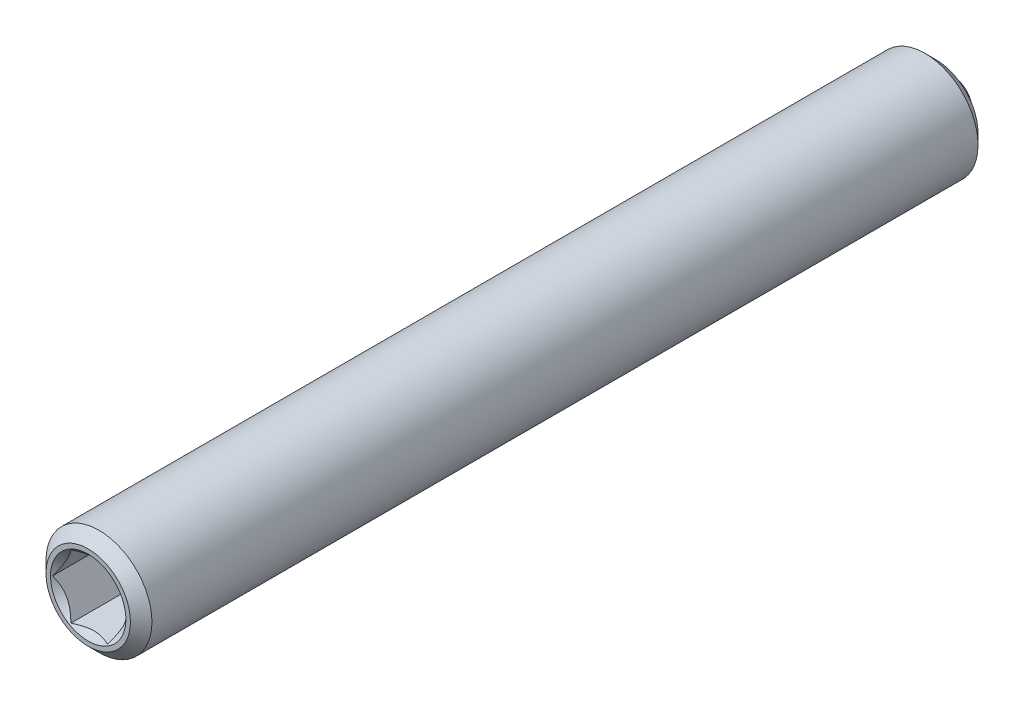
ISO-10303-21;
HEADER;
FILE_DESCRIPTION(('STEP AP214'),'2;1');
FILE_NAME('part.step','',(''),(''),'','','');
FILE_SCHEMA(('AUTOMOTIVE_DESIGN { 1 0 10303 214 1 1 1 1 }'));
ENDSEC;
DATA;
#1=APPLICATION_CONTEXT('core data for automotive mechanical design processes');
#2=APPLICATION_PROTOCOL_DEFINITION('international standard','automotive_design',2000,#1);
#3=PRODUCT_CONTEXT('',#1,'mechanical');
#4=PRODUCT('Part','Part','',(#3));
#5=PRODUCT_RELATED_PRODUCT_CATEGORY('part','',(#4));
#6=PRODUCT_DEFINITION_FORMATION('','',#4);
#7=PRODUCT_DEFINITION_CONTEXT('part definition',#1,'design');
#8=PRODUCT_DEFINITION('design','',#6,#7);
#9=PRODUCT_DEFINITION_SHAPE('','',#8);
#10=(LENGTH_UNIT() NAMED_UNIT(*) SI_UNIT(.MILLI.,.METRE.));
#11=(NAMED_UNIT(*) PLANE_ANGLE_UNIT() SI_UNIT($,.RADIAN.));
#12=(NAMED_UNIT(*) SI_UNIT($,.STERADIAN.) SOLID_ANGLE_UNIT());
#13=UNCERTAINTY_MEASURE_WITH_UNIT(LENGTH_MEASURE(1.E-05),#10,'distance_accuracy_value','');
#14=(GEOMETRIC_REPRESENTATION_CONTEXT(3) GLOBAL_UNCERTAINTY_ASSIGNED_CONTEXT((#13)) GLOBAL_UNIT_ASSIGNED_CONTEXT((#10,
#11,#12)) REPRESENTATION_CONTEXT('',''));
#15=CARTESIAN_POINT('',(0.,0.,0.));
#16=DIRECTION('',(0.,0.,1.));
#17=DIRECTION('',(1.,0.,0.));
#18=AXIS2_PLACEMENT_3D('',#15,#16,#17);
#19=CARTESIAN_POINT('',(-33.1630007981403,28.7089673374794,7.99521483447506));
#20=DIRECTION('',(0.,0.,-1.));
#21=DIRECTION('',(-1.,0.,0.));
#22=AXIS2_PLACEMENT_3D('',#19,#20,#21);
#23=PLANE('',#22);
#24=CARTESIAN_POINT('',(-33.1630007981403,28.7089673374794,7.99521483447506));
#25=DIRECTION('',(0.,0.,-1.));
#26=DIRECTION('',(0.,1.,0.));
#27=AXIS2_PLACEMENT_3D('',#24,#25,#26);
#28=CIRCLE('',#27,0.889);
#29=CARTESIAN_POINT('',(-33.1630007981403,29.5979673374794,7.99521483447506));
#30=VERTEX_POINT('',#29);
#31=EDGE_CURVE('P0_E164',#30,#30,#28,.T.);
#32=ORIENTED_EDGE('',*,*,#31,.T.);
#33=EDGE_LOOP('',(#32));
#34=FACE_BOUND('',#33,.T.);
#35=CARTESIAN_POINT('',(-33.1630007981403,28.7089673374794,7.99521483447506));
#36=DIRECTION('',(0.,0.,1.));
#37=DIRECTION('',(1.,0.,0.));
#38=AXIS2_PLACEMENT_3D('',#35,#36,#37);
#39=CIRCLE('',#38,0.996);
#40=CARTESIAN_POINT('',(-32.1670007981403,28.7089673374794,7.99521483447506));
#41=VERTEX_POINT('',#40);
#42=EDGE_CURVE('P0_E29',#41,#41,#39,.T.);
#43=ORIENTED_EDGE('',*,*,#42,.T.);
#44=EDGE_LOOP('',(#43));
#45=FACE_BOUND('',#44,.T.);
#46=ADVANCED_FACE('P0_F17',(#34,#45),#23,.F.);
#47=CARTESIAN_POINT('',(-33.1630007981403,28.7089673374794,7.74121483447506));
#48=DIRECTION('',(0.,0.,-1.));
#49=DIRECTION('',(-1.,0.,0.));
#50=AXIS2_PLACEMENT_3D('',#47,#48,#49);
#51=CONICAL_SURFACE('',#50,1.25,0.78539816339744);
#52=ORIENTED_EDGE('',*,*,#42,.F.);
#53=EDGE_LOOP('',(#52));
#54=FACE_BOUND('',#53,.T.);
#55=CARTESIAN_POINT('',(-33.1630007981403,28.7089673374794,7.74121483447506));
#56=DIRECTION('',(0.,0.,1.));
#57=DIRECTION('',(1.,0.,0.));
#58=AXIS2_PLACEMENT_3D('',#55,#56,#57);
#59=CIRCLE('',#58,1.25);
#60=CARTESIAN_POINT('',(-31.9130007981403,28.7089673374794,7.74121483447506));
#61=VERTEX_POINT('',#60);
#62=EDGE_CURVE('P0_E113',#61,#61,#59,.T.);
#63=ORIENTED_EDGE('',*,*,#62,.T.);
#64=EDGE_LOOP('',(#63));
#65=FACE_BOUND('',#64,.T.);
#66=ADVANCED_FACE('P0_F119',(#54,#65),#51,.T.);
#67=CARTESIAN_POINT('',(-33.1630007981403,28.7089673374794,57.6778825031788));
#68=DIRECTION('',(0.,0.,1.));
#69=DIRECTION('',(1.,0.,0.));
#70=AXIS2_PLACEMENT_3D('',#67,#68,#69);
#71=CYLINDRICAL_SURFACE('',#70,1.25);
#72=ORIENTED_EDGE('',*,*,#62,.F.);
#73=EDGE_LOOP('',(#72));
#74=FACE_BOUND('',#73,.T.);
#75=CARTESIAN_POINT('',(-33.1630007981403,28.7089673374794,-11.7507851655249));
#76=DIRECTION('',(0.,0.,1.));
#77=DIRECTION('',(1.,0.,0.));
#78=AXIS2_PLACEMENT_3D('',#75,#76,#77);
#79=CIRCLE('',#78,1.25);
#80=CARTESIAN_POINT('',(-31.9130007981403,28.7089673374794,-11.7507851655249));
#81=VERTEX_POINT('',#80);
#82=EDGE_CURVE('P0_E110',#81,#81,#79,.T.);
#83=ORIENTED_EDGE('',*,*,#82,.T.);
#84=EDGE_LOOP('',(#83));
#85=FACE_BOUND('',#84,.T.);
#86=ADVANCED_FACE('P0_F122',(#74,#85),#71,.T.);
#87=CARTESIAN_POINT('',(-33.1630007981403,28.7089673374794,-12.0047851655249));
#88=DIRECTION('',(0.,0.,1.));
#89=DIRECTION('',(1.,0.,0.));
#90=AXIS2_PLACEMENT_3D('',#87,#88,#89);
#91=CONICAL_SURFACE('',#90,0.996,0.78539816339744);
#92=ORIENTED_EDGE('',*,*,#82,.F.);
#93=EDGE_LOOP('',(#92));
#94=FACE_BOUND('',#93,.T.);
#95=CARTESIAN_POINT('',(-33.1630007981403,28.7089673374794,-12.0047851655249));
#96=DIRECTION('',(0.,0.,1.));
#97=DIRECTION('',(1.,0.,0.));
#98=AXIS2_PLACEMENT_3D('',#95,#96,#97);
#99=CIRCLE('',#98,0.996);
#100=CARTESIAN_POINT('',(-32.1670007981403,28.7089673374794,-12.0047851655249));
#101=VERTEX_POINT('',#100);
#102=EDGE_CURVE('P0_E107',#101,#101,#99,.T.);
#103=ORIENTED_EDGE('',*,*,#102,.T.);
#104=EDGE_LOOP('',(#103));
#105=FACE_BOUND('',#104,.T.);
#106=ADVANCED_FACE('P0_F127',(#94,#105),#91,.T.);
#107=CARTESIAN_POINT('',(-33.1630007981403,29.7049673374794,-12.0047851655249));
#108=DIRECTION('',(0.,0.,1.));
#109=DIRECTION('',(1.,0.,0.));
#110=AXIS2_PLACEMENT_3D('',#107,#108,#109);
#111=PLANE('',#110);
#112=ORIENTED_EDGE('',*,*,#102,.F.);
#113=EDGE_LOOP('',(#112));
#114=FACE_BOUND('',#113,.T.);
#115=CARTESIAN_POINT('',(-33.1630007981403,28.7089673374794,-12.0047851655249));
#116=DIRECTION('',(0.,0.,1.));
#117=DIRECTION('',(1.,0.,0.));
#118=AXIS2_PLACEMENT_3D('',#115,#116,#117);
#119=CIRCLE('',#118,0.75);
#120=CARTESIAN_POINT('',(-32.4130007981403,28.7089673374794,-12.0047851655249));
#121=VERTEX_POINT('',#120);
#122=EDGE_CURVE('P0_E104',#121,#121,#119,.T.);
#123=ORIENTED_EDGE('',*,*,#122,.T.);
#124=EDGE_LOOP('',(#123));
#125=FACE_BOUND('',#124,.T.);
#126=ADVANCED_FACE('P0_F133',(#114,#125),#111,.F.);
#127=CARTESIAN_POINT('',(-33.1630007981403,28.7089673374794,57.6778825031788));
#128=DIRECTION('',(0.,0.,1.));
#129=DIRECTION('',(1.,0.,0.));
#130=AXIS2_PLACEMENT_3D('',#127,#128,#129);
#131=CYLINDRICAL_SURFACE('',#130,0.75);
#132=ORIENTED_EDGE('',*,*,#122,.F.);
#133=EDGE_LOOP('',(#132));
#134=FACE_BOUND('',#133,.T.);
#135=CARTESIAN_POINT('',(-33.1630007981403,28.7089673374794,-11.5029249937451));
#136=DIRECTION('',(0.,0.,1.));
#137=DIRECTION('',(1.,0.,0.));
#138=AXIS2_PLACEMENT_3D('',#135,#136,#137);
#139=CIRCLE('',#138,0.75);
#140=CARTESIAN_POINT('',(-32.4130007981403,28.7089673374794,-11.5029249937451));
#141=VERTEX_POINT('',#140);
#142=EDGE_CURVE('P0_E101',#141,#141,#139,.T.);
#143=ORIENTED_EDGE('',*,*,#142,.T.);
#144=EDGE_LOOP('',(#143));
#145=FACE_BOUND('',#144,.T.);
#146=ADVANCED_FACE('P0_F139',(#134,#145),#131,.F.);
#147=CARTESIAN_POINT('',(-33.1630007981403,28.7089673374794,-10.7529249937451));
#148=DIRECTION('',(0.,0.,-1.));
#149=DIRECTION('',(-1.,0.,0.));
#150=AXIS2_PLACEMENT_3D('',#147,#148,#149);
#151=CONICAL_SURFACE('',#150,0.,0.785398163397435);
#152=ORIENTED_EDGE('',*,*,#142,.F.);
#153=EDGE_LOOP('',(#152));
#154=FACE_BOUND('',#153,.T.);
#155=CARTESIAN_POINT('',(-33.1630007981403,28.7089673374794,-10.7529249937451));
#156=VERTEX_POINT('',#155);
#157=VERTEX_LOOP('',#156);
#158=FACE_BOUND('',#157,.T.);
#159=ADVANCED_FACE('P0_F145',(#154,#158),#151,.F.);
#160=CARTESIAN_POINT('',(-33.1630007981403,28.7089673374794,7.10621483447507));
#161=DIRECTION('',(0.,0.,1.));
#162=DIRECTION('',(0.,-1.,0.));
#163=AXIS2_PLACEMENT_3D('',#160,#161,#162);
#164=CONICAL_SURFACE('',#163,0.,0.785398163397454);
#165=ORIENTED_EDGE('',*,*,#31,.F.);
#166=EDGE_LOOP('',(#165));
#167=FACE_BOUND('',#166,.T.);
#168=CARTESIAN_POINT('',(-34.0425134321986,27.9589673374794,8.26208786966026));
#169=CARTESIAN_POINT('',(-34.0211681100344,27.9589673374794,8.24584847947383));
#170=CARTESIAN_POINT('',(-33.9997055705422,27.9589673374794,8.22976358783385));
#171=CARTESIAN_POINT('',(-33.9564979950275,27.9589673374794,8.19796706739638));
#172=CARTESIAN_POINT('',(-33.9347528915436,27.9589673374794,8.18225553036632));
#173=CARTESIAN_POINT('',(-33.8687032144859,27.9589673374794,8.13555296646633));
#174=CARTESIAN_POINT('',(-33.8239085172943,27.9589673374794,8.10524382432147));
#175=CARTESIAN_POINT('',(-33.7298709247186,27.9589673374794,8.04559584174304));
#176=CARTESIAN_POINT('',(-33.6805219918868,27.9589673374794,8.01642227384624));
#177=CARTESIAN_POINT('',(-33.579342395383,27.9589673374794,7.96295382695283));
#178=CARTESIAN_POINT('',(-33.5275208693121,27.9589673374794,7.93864248318659));
#179=CARTESIAN_POINT('',(-33.4498788861714,27.9589673374794,7.90889806815176));
#180=CARTESIAN_POINT('',(-33.4252462031009,27.9589673374794,7.90038894634061));
#181=CARTESIAN_POINT('',(-33.3753858857222,27.9589673374794,7.88534110821305));
#182=CARTESIAN_POINT('',(-33.3501582118539,27.9589673374794,7.87880252331568));
#183=CARTESIAN_POINT('',(-33.2746553170791,27.9589673374794,7.86292205991524));
#184=CARTESIAN_POINT('',(-33.2235971883066,27.9589673374794,7.85692036145107));
#185=CARTESIAN_POINT('',(-33.1233397305914,27.9589673374794,7.85565407881637));
#186=CARTESIAN_POINT('',(-33.0741456969587,27.9589673374794,7.85997925251151));
#187=CARTESIAN_POINT('',(-33.0012050800911,27.9589673374794,7.87307755969887));
#188=CARTESIAN_POINT('',(-32.9768127738478,27.9589673374794,7.87862812797235));
#189=CARTESIAN_POINT('',(-32.9285520824627,27.9589673374794,7.89166394378377));
#190=CARTESIAN_POINT('',(-32.9046836591211,27.9589673374794,7.89914904975033));
#191=CARTESIAN_POINT('',(-32.8302496642989,27.9589673374794,7.92532907949656));
#192=CARTESIAN_POINT('',(-32.7807289039953,27.9589673374794,7.94697769298002));
#193=CARTESIAN_POINT('',(-32.6840052994642,27.9589673374794,7.99512867272661));
#194=CARTESIAN_POINT('',(-32.6368115002835,27.9589673374794,8.02164833509716));
#195=CARTESIAN_POINT('',(-32.546608344391,27.9589673374794,8.07638182509845));
#196=CARTESIAN_POINT('',(-32.5035074965681,27.9589673374794,8.10444679240507));
#197=CARTESIAN_POINT('',(-32.4400071849266,27.9589673374794,8.14784121680964));
#198=CARTESIAN_POINT('',(-32.4191140713776,27.9589673374794,8.16246076309093));
#199=CARTESIAN_POINT('',(-32.3776138434408,27.9589673374794,8.19208888193887));
#200=CARTESIAN_POINT('',(-32.3570066523079,27.9589673374794,8.20709734688724));
#201=CARTESIAN_POINT('',(-32.3365186272487,27.9589673374794,8.22226715350033));
#202=B_SPLINE_CURVE_WITH_KNOTS('',3,(#168,#169,#170,#171,#172,#173,#174,#175,#176,#177,#178,
#179,#180,#181,#182,#183,#184,#185,#186,#187,#188,#189,#190,#191,#192,#193,#194,#195,#196,#197,
#198,#199,#200,#201),.UNSPECIFIED.,.F.,.F.,(4,2,2,2,2,2,2,2,2,2,2,2,2,2,2,2,4),(0.,
0.0804596117681692,0.160938799452028,0.323124453194978,0.494968571191827,0.66622054222909,
0.74433117166594,0.822447009304216,0.975597152051806,1.1227651436875,1.19774306447282,
1.2727154998528,1.43438364653412,1.59663734906445,1.75085876684993,1.82735598888856,
1.90383226465776),.UNSPECIFIED.);
#203=CARTESIAN_POINT('',(-33.5960135000325,27.9589673374794,7.9722402382595));
#204=VERTEX_POINT('',#203);
#205=CARTESIAN_POINT('',(-32.7299880962481,27.9589673374794,7.9722402382595));
#206=VERTEX_POINT('',#205);
#207=EDGE_CURVE('P0_E85',#204,#206,#202,.T.);
#208=ORIENTED_EDGE('',*,*,#207,.F.);
#209=CARTESIAN_POINT('',(-34.0291416719786,28.7091673374794,7.97235573140427));
#210=CARTESIAN_POINT('',(-34.0142518301535,28.6833773749217,7.95747434872343));
#211=CARTESIAN_POINT('',(-33.9991129904287,28.6571561353507,7.94346650386646));
#212=CARTESIAN_POINT('',(-33.9682429340346,28.6036876292437,7.91781776294176));
#213=CARTESIAN_POINT('',(-33.9525087771001,28.5764352700188,7.90619114996517));
#214=CARTESIAN_POINT('',(-33.9207814844129,28.5214819870981,7.88627428403174));
#215=CARTESIAN_POINT('',(-33.9047964415994,28.4937950807839,7.87793393234087));
#216=CARTESIAN_POINT('',(-33.8724744460836,28.4378117423485,7.86508298022093));
#217=CARTESIAN_POINT('',(-33.8561384820408,28.4095170226358,7.86056277884834));
#218=CARTESIAN_POINT('',(-33.8279868976807,28.3607570482106,7.85648607135694));
#219=CARTESIAN_POINT('',(-33.8162079265919,28.3403552718238,7.85588303487358));
#220=CARTESIAN_POINT('',(-33.792672780358,28.299591202783,7.85689474427503));
#221=CARTESIAN_POINT('',(-33.7809166108125,28.279228919828,7.85850997924953));
#222=CARTESIAN_POINT('',(-33.7458159514267,28.2184327943926,7.86657638523254));
#223=CARTESIAN_POINT('',(-33.722646127693,28.1783014824833,7.87624917408722));
#224=CARTESIAN_POINT('',(-33.6819749504676,28.1078569371254,7.89959655623182));
#225=CARTESIAN_POINT('',(-33.6642831070638,28.0772137654703,7.91204879633176));
#226=CARTESIAN_POINT('',(-33.6295925693883,28.0171279916746,7.94009984849036));
#227=CARTESIAN_POINT('',(-33.612591831045,27.9876818490978,7.95568842416325));
#228=CARTESIAN_POINT('',(-33.5958980299787,27.9587673374794,7.97235573140427));
#229=B_SPLINE_CURVE_WITH_KNOTS('',3,(#209,#210,#211,#212,#213,#214,#215,#216,#217,#218,#219,
#220,#221,#222,#223,#224,#225,#226,#227,#228),.UNSPECIFIED.,.F.,.F.,(4,2,2,2,2,2,2,2,2,4),(0.,
0.0999419466095622,0.200466857654447,0.299393763705727,0.39807129730023,0.468665775681749,
0.539275821398842,0.68053625724457,0.792918418368075,0.904939568716029),.UNSPECIFIED.);
#230=CARTESIAN_POINT('',(-34.0290262019247,28.7089673374794,7.9722402382595));
#231=VERTEX_POINT('',#230);
#232=EDGE_CURVE('P0_E227',#231,#204,#229,.T.);
#233=ORIENTED_EDGE('',*,*,#232,.F.);
#234=CARTESIAN_POINT('',(-33.5958980299787,29.4591673374794,7.97235573140427));
#235=CARTESIAN_POINT('',(-33.6107878718037,29.4333773749217,7.95747434872343));
#236=CARTESIAN_POINT('',(-33.6259267115285,29.4071561353508,7.94346650386646));
#237=CARTESIAN_POINT('',(-33.6567967679226,29.3536876292437,7.91781776294176));
#238=CARTESIAN_POINT('',(-33.6725309248571,29.3264352700188,7.90619114996517));
#239=CARTESIAN_POINT('',(-33.7042582175443,29.2714819870981,7.88627428403175));
#240=CARTESIAN_POINT('',(-33.7202432603578,29.2437950807839,7.87793393234088));
#241=CARTESIAN_POINT('',(-33.7525652558736,29.1878117423486,7.86508298022093));
#242=CARTESIAN_POINT('',(-33.7689012199164,29.1595170226358,7.86056277884834));
#243=CARTESIAN_POINT('',(-33.7970528042765,29.1107570482106,7.85648607135694));
#244=CARTESIAN_POINT('',(-33.8088317753653,29.0903552718238,7.85588303487358));
#245=CARTESIAN_POINT('',(-33.8323669215993,29.049591202783,7.85689474427503));
#246=CARTESIAN_POINT('',(-33.8441230911447,29.029228919828,7.85850997924954));
#247=CARTESIAN_POINT('',(-33.8792237505305,28.9684327943926,7.86657638523255));
#248=CARTESIAN_POINT('',(-33.9023935742642,28.9283014824833,7.87624917408722));
#249=CARTESIAN_POINT('',(-33.9430647514896,28.8578569371254,7.89959655623182));
#250=CARTESIAN_POINT('',(-33.9607565948934,28.8272137654703,7.91204879633176));
#251=CARTESIAN_POINT('',(-33.9954471325689,28.7671279916746,7.94009984849037));
#252=CARTESIAN_POINT('',(-34.0124478709122,28.7376818490978,7.95568842416326));
#253=CARTESIAN_POINT('',(-34.0291416719786,28.7087673374794,7.97235573140427));
#254=B_SPLINE_CURVE_WITH_KNOTS('',3,(#234,#235,#236,#237,#238,#239,#240,#241,#242,#243,#244,
#245,#246,#247,#248,#249,#250,#251,#252,#253),.UNSPECIFIED.,.F.,.F.,(4,2,2,2,2,2,2,2,2,4),(0.,
0.0999419466095573,0.200466857654448,0.299393763705718,0.398071297300228,0.468665775681747,
0.539275821398841,0.680536257244568,0.79291841836807,0.904939568716026),.UNSPECIFIED.);
#255=CARTESIAN_POINT('',(-33.5960135000325,29.4589673374794,7.9722402382595));
#256=VERTEX_POINT('',#255);
#257=EDGE_CURVE('P0_E166',#256,#231,#254,.T.);
#258=ORIENTED_EDGE('',*,*,#257,.F.);
#259=CARTESIAN_POINT('',(-34.0425134322245,29.4589673374794,8.26208786967997));
#260=CARTESIAN_POINT('',(-34.0211681100595,29.4589673374794,8.24584847949278));
#261=CARTESIAN_POINT('',(-33.9997055705666,29.4589673374794,8.22976358785203));
#262=CARTESIAN_POINT('',(-33.9564979950504,29.4589673374794,8.19796706741305));
#263=CARTESIAN_POINT('',(-33.9347528915658,29.4589673374794,8.18225553038223));
#264=CARTESIAN_POINT('',(-33.8687032145059,29.4589673374794,8.13555296647996));
#265=CARTESIAN_POINT('',(-33.8239085173127,29.4589673374794,8.10524382433359));
#266=CARTESIAN_POINT('',(-33.7298709247336,29.4589673374794,8.04559584175204));
#267=CARTESIAN_POINT('',(-33.6805219919,29.4589673374794,8.01642227385365));
#268=CARTESIAN_POINT('',(-33.5793423953923,29.4589673374794,7.96295382695729));
#269=CARTESIAN_POINT('',(-33.5275208693194,29.4589673374794,7.93864248318969));
#270=CARTESIAN_POINT('',(-33.4498788861772,29.4589673374794,7.90889806815386));
#271=CARTESIAN_POINT('',(-33.4252462031073,29.4589673374794,7.90038894634277));
#272=CARTESIAN_POINT('',(-33.3753858857299,29.4589673374794,7.88534110821519));
#273=CARTESIAN_POINT('',(-33.3501582118623,29.4589673374794,7.87880252331774));
#274=CARTESIAN_POINT('',(-33.2746553170894,29.4589673374794,7.86292205991685));
#275=CARTESIAN_POINT('',(-33.2235971883182,29.4589673374794,7.85692036145209));
#276=CARTESIAN_POINT('',(-33.1233397306052,29.4589673374794,7.85565407881571));
#277=CARTESIAN_POINT('',(-33.0741456969734,29.4589673374794,7.85997925250981));
#278=CARTESIAN_POINT('',(-33.0012050801071,29.4589673374794,7.87307755969551));
#279=CARTESIAN_POINT('',(-32.9768127738643,29.4589673374794,7.87862812796839));
#280=CARTESIAN_POINT('',(-32.9285520824799,29.4589673374794,7.89166394377863));
#281=CARTESIAN_POINT('',(-32.9046836591387,29.4589673374794,7.8991490497446));
#282=CARTESIAN_POINT('',(-32.8302496643203,29.4589673374794,7.92532907948803));
#283=CARTESIAN_POINT('',(-32.78072890402,29.4589673374794,7.94697769296892));
#284=CARTESIAN_POINT('',(-32.684005299495,29.4589673374794,7.99512867271008));
#285=CARTESIAN_POINT('',(-32.6368115003173,29.4589673374794,8.02164833507777));
#286=CARTESIAN_POINT('',(-32.5466083444301,29.4589673374794,8.0763818250736));
#287=CARTESIAN_POINT('',(-32.5035074966097,29.4589673374794,8.10444679237763));
#288=CARTESIAN_POINT('',(-32.4400071849717,29.4589673374794,8.14784121677834));
#289=CARTESIAN_POINT('',(-32.4191140714238,29.4589673374794,8.16246076305834));
#290=CARTESIAN_POINT('',(-32.3776138434894,29.4589673374794,8.19208888190373));
#291=CARTESIAN_POINT('',(-32.3570066523577,29.4589673374794,8.20709734685082));
#292=CARTESIAN_POINT('',(-32.3365186272996,29.4589673374794,8.22226715346264));
#293=B_SPLINE_CURVE_WITH_KNOTS('',3,(#259,#260,#261,#262,#263,#264,#265,#266,#267,#268,#269,
#270,#271,#272,#273,#274,#275,#276,#277,#278,#279,#280,#281,#282,#283,#284,#285,#286,#287,#288,
#289,#290,#291,#292),.UNSPECIFIED.,.F.,.F.,(4,2,2,2,2,2,2,2,2,2,2,2,2,2,2,2,4),(0.,
0.0804596117713149,0.160938799458311,0.323124453207652,0.494968571211675,0.666220542256054,
0.744331171691057,0.822447009327489,0.975597152071558,1.12276514370424,1.19774306448794,
1.2727154998663,1.43438364653571,1.59663734905406,1.75085876682929,1.82735598886285,
1.90383226462701),.UNSPECIFIED.);
#294=CARTESIAN_POINT('',(-32.7299880962481,29.4589673374794,7.9722402382595));
#295=VERTEX_POINT('',#294);
#296=EDGE_CURVE('P0_E36',#295,#256,#293,.F.);
#297=ORIENTED_EDGE('',*,*,#296,.F.);
#298=CARTESIAN_POINT('',(-32.296859924302,28.7087673374794,7.97235573140427));
#299=CARTESIAN_POINT('',(-32.3117497661271,28.7345573000371,7.95747434872343));
#300=CARTESIAN_POINT('',(-32.3268886058519,28.7607785396081,7.94346650386646));
#301=CARTESIAN_POINT('',(-32.3577586622459,28.8142470457151,7.91781776294176));
#302=CARTESIAN_POINT('',(-32.3734928191805,28.84149940494,7.90619114996517));
#303=CARTESIAN_POINT('',(-32.4052201118676,28.8964526878608,7.88627428403175));
#304=CARTESIAN_POINT('',(-32.4212051546811,28.9241395941749,7.87793393234087));
#305=CARTESIAN_POINT('',(-32.4535271501969,28.9801229326103,7.86508298022093));
#306=CARTESIAN_POINT('',(-32.4698631142397,29.0084176523231,7.86056277884834));
#307=CARTESIAN_POINT('',(-32.4980146985998,29.0571776267483,7.85648607135694));
#308=CARTESIAN_POINT('',(-32.5097936696886,29.077579403135,7.85588303487358));
#309=CARTESIAN_POINT('',(-32.5333288159226,29.1183434721758,7.85689474427503));
#310=CARTESIAN_POINT('',(-32.545084985468,29.1387057551309,7.85850997924953));
#311=CARTESIAN_POINT('',(-32.5801856448538,29.1995018805662,7.86657638523254));
#312=CARTESIAN_POINT('',(-32.6033554685876,29.2396331924755,7.87624917408722));
#313=CARTESIAN_POINT('',(-32.6440266458129,29.3100777378334,7.89959655623182));
#314=CARTESIAN_POINT('',(-32.6617184892168,29.3407209094885,7.91204879633176));
#315=CARTESIAN_POINT('',(-32.6964090268922,29.4008066832842,7.94009984849036));
#316=CARTESIAN_POINT('',(-32.7134097652355,29.430252825861,7.95568842416325));
#317=CARTESIAN_POINT('',(-32.7301035663019,29.4591673374794,7.97235573140427));
#318=B_SPLINE_CURVE_WITH_KNOTS('',3,(#298,#299,#300,#301,#302,#303,#304,#305,#306,#307,#308,
#309,#310,#311,#312,#313,#314,#315,#316,#317),.UNSPECIFIED.,.F.,.F.,(4,2,2,2,2,2,2,2,2,4),(0.,
0.0999419466095622,0.200466857654447,0.299393763705714,0.39807129730023,0.468665775681749,
0.539275821398842,0.68053625724457,0.792918418368072,0.904939568716029),.UNSPECIFIED.);
#319=CARTESIAN_POINT('',(-32.2969753943558,28.7089673374794,7.9722402382595));
#320=VERTEX_POINT('',#319);
#321=EDGE_CURVE('P0_E11',#320,#295,#318,.T.);
#322=ORIENTED_EDGE('',*,*,#321,.F.);
#323=CARTESIAN_POINT('',(-32.7301035663019,27.9587673374794,7.97235573140427));
#324=CARTESIAN_POINT('',(-32.7152137244768,27.9845573000371,7.95747434872343));
#325=CARTESIAN_POINT('',(-32.700074884752,28.0107785396081,7.94346650386646));
#326=CARTESIAN_POINT('',(-32.669204828358,28.0642470457151,7.91781776294176));
#327=CARTESIAN_POINT('',(-32.6534706714234,28.09149940494,7.90619114996517));
#328=CARTESIAN_POINT('',(-32.6217433787363,28.1464526878608,7.88627428403175));
#329=CARTESIAN_POINT('',(-32.6057583359228,28.1741395941749,7.87793393234088));
#330=CARTESIAN_POINT('',(-32.573436340407,28.2301229326103,7.86508298022093));
#331=CARTESIAN_POINT('',(-32.5571003763642,28.2584176523231,7.86056277884834));
#332=CARTESIAN_POINT('',(-32.5289487920041,28.3071776267483,7.85648607135694));
#333=CARTESIAN_POINT('',(-32.5171698209153,28.327579403135,7.85588303487358));
#334=CARTESIAN_POINT('',(-32.4936346746813,28.3683434721758,7.85689474427503));
#335=CARTESIAN_POINT('',(-32.4818785051359,28.3887057551309,7.85850997924954));
#336=CARTESIAN_POINT('',(-32.4467778457501,28.4495018805662,7.86657638523255));
#337=CARTESIAN_POINT('',(-32.4236080220163,28.4896331924755,7.87624917408722));
#338=CARTESIAN_POINT('',(-32.382936844791,28.5600777378334,7.89959655623182));
#339=CARTESIAN_POINT('',(-32.3652450013871,28.5907209094885,7.91204879633176));
#340=CARTESIAN_POINT('',(-32.3305544637117,28.6508066832842,7.94009984849037));
#341=CARTESIAN_POINT('',(-32.3135537253684,28.680252825861,7.95568842416326));
#342=CARTESIAN_POINT('',(-32.296859924302,28.7091673374794,7.97235573140427));
#343=B_SPLINE_CURVE_WITH_KNOTS('',3,(#323,#324,#325,#326,#327,#328,#329,#330,#331,#332,#333,
#334,#335,#336,#337,#338,#339,#340,#341,#342),.UNSPECIFIED.,.F.,.F.,(4,2,2,2,2,2,2,2,2,4),(0.,
0.0999419466095573,0.200466857654448,0.299393763705722,0.398071297300235,0.468665775681753,
0.539275821398844,0.680536257244571,0.792918418368077,0.904939568716027),.UNSPECIFIED.);
#344=EDGE_CURVE('P0_E72',#206,#320,#343,.T.);
#345=ORIENTED_EDGE('',*,*,#344,.F.);
#346=EDGE_LOOP('',(#208,#233,#258,#297,#322,#345));
#347=FACE_BOUND('',#346,.T.);
#348=ADVANCED_FACE('P0_F71',(#167,#347),#164,.F.);
#349=CARTESIAN_POINT('',(-32.2969753943558,28.7089673374794,4.94721483447506));
#350=DIRECTION('',(0.,0.,1.));
#351=DIRECTION('',(1.,0.,0.));
#352=AXIS2_PLACEMENT_3D('',#349,#350,#351);
#353=PLANE('',#352);
#354=DIRECTION('',(0.5,0.866025403784439,0.));
#355=VECTOR('',#354,1.);
#356=CARTESIAN_POINT('',(-32.7299880962481,27.9589673374794,4.94721483447506));
#357=LINE('',#356,#355);
#358=CARTESIAN_POINT('',(-32.7299880962481,27.9589673374794,4.94721483447506));
#359=VERTEX_POINT('',#358);
#360=CARTESIAN_POINT('',(-32.2969753943558,28.7089673374794,4.94721483447506));
#361=VERTEX_POINT('',#360);
#362=EDGE_CURVE('P0_E84',#359,#361,#357,.T.);
#363=ORIENTED_EDGE('',*,*,#362,.T.);
#364=DIRECTION('',(-0.500000000000001,0.866025403784438,0.));
#365=VECTOR('',#364,1.);
#366=CARTESIAN_POINT('',(-32.2969753943558,28.7089673374794,4.94721483447506));
#367=LINE('',#366,#365);
#368=CARTESIAN_POINT('',(-32.7299880962481,29.4589673374794,4.94721483447506));
#369=VERTEX_POINT('',#368);
#370=EDGE_CURVE('P0_E89',#361,#369,#367,.T.);
#371=ORIENTED_EDGE('',*,*,#370,.T.);
#372=DIRECTION('',(-1.,0.,0.));
#373=VECTOR('',#372,1.);
#374=CARTESIAN_POINT('',(-32.7299880962481,29.4589673374794,4.94721483447506));
#375=LINE('',#374,#373);
#376=CARTESIAN_POINT('',(-33.5960135000325,29.4589673374794,4.94721483447506));
#377=VERTEX_POINT('',#376);
#378=EDGE_CURVE('P0_E203',#369,#377,#375,.T.);
#379=ORIENTED_EDGE('',*,*,#378,.T.);
#380=DIRECTION('',(-0.5,-0.866025403784439,0.));
#381=VECTOR('',#380,1.);
#382=CARTESIAN_POINT('',(-33.5960135000325,29.4589673374794,4.94721483447506));
#383=LINE('',#382,#381);
#384=CARTESIAN_POINT('',(-34.0290262019247,28.7089673374794,4.94721483447506));
#385=VERTEX_POINT('',#384);
#386=EDGE_CURVE('P0_E206',#377,#385,#383,.T.);
#387=ORIENTED_EDGE('',*,*,#386,.T.);
#388=DIRECTION('',(0.5,-0.866025403784438,0.));
#389=VECTOR('',#388,1.);
#390=CARTESIAN_POINT('',(-34.0290262019247,28.7089673374794,4.94721483447506));
#391=LINE('',#390,#389);
#392=CARTESIAN_POINT('',(-33.5960135000325,27.9589673374794,4.94721483447506));
#393=VERTEX_POINT('',#392);
#394=EDGE_CURVE('P0_E97',#385,#393,#391,.T.);
#395=ORIENTED_EDGE('',*,*,#394,.T.);
#396=DIRECTION('',(1.,0.,0.));
#397=VECTOR('',#396,1.);
#398=CARTESIAN_POINT('',(-33.5960135000325,27.9589673374794,4.94721483447506));
#399=LINE('',#398,#397);
#400=EDGE_CURVE('P0_E92',#393,#359,#399,.T.);
#401=ORIENTED_EDGE('',*,*,#400,.T.);
#402=EDGE_LOOP('',(#363,#371,#379,#387,#395,#401));
#403=FACE_BOUND('',#402,.T.);
#404=ADVANCED_FACE('P0_F155',(#403),#353,.T.);
#405=CARTESIAN_POINT('',(-32.2969753943558,28.7089673374794,4.94721483447506));
#406=DIRECTION('',(0.866025403784438,0.500000000000001,0.));
#407=DIRECTION('',(-0.500000000000001,0.866025403784438,0.));
#408=AXIS2_PLACEMENT_3D('',#405,#406,#407);
#409=PLANE('',#408);
#410=DIRECTION('',(0.,0.,1.));
#411=VECTOR('',#410,1.);
#412=CARTESIAN_POINT('',(-32.2969753943558,28.7089673374794,4.94721483447506));
#413=LINE('',#412,#411);
#414=EDGE_CURVE('P0_E81',#361,#320,#413,.T.);
#415=ORIENTED_EDGE('',*,*,#414,.T.);
#416=ORIENTED_EDGE('',*,*,#321,.T.);
#417=DIRECTION('',(0.,0.,1.));
#418=VECTOR('',#417,1.);
#419=CARTESIAN_POINT('',(-32.7299880962481,29.4589673374794,4.94721483447506));
#420=LINE('',#419,#418);
#421=EDGE_CURVE('P0_E91',#369,#295,#420,.T.);
#422=ORIENTED_EDGE('',*,*,#421,.F.);
#423=ORIENTED_EDGE('',*,*,#370,.F.);
#424=EDGE_LOOP('',(#415,#416,#422,#423));
#425=FACE_BOUND('',#424,.T.);
#426=ADVANCED_FACE('P0_F87',(#425),#409,.F.);
#427=CARTESIAN_POINT('',(-32.7299880962481,29.4589673374794,4.94721483447506));
#428=DIRECTION('',(0.,1.,0.));
#429=DIRECTION('',(-1.,0.,0.));
#430=AXIS2_PLACEMENT_3D('',#427,#428,#429);
#431=PLANE('',#430);
#432=ORIENTED_EDGE('',*,*,#421,.T.);
#433=ORIENTED_EDGE('',*,*,#296,.T.);
#434=DIRECTION('',(0.,0.,1.));
#435=VECTOR('',#434,1.);
#436=CARTESIAN_POINT('',(-33.5960135000325,29.4589673374794,4.94721483447506));
#437=LINE('',#436,#435);
#438=EDGE_CURVE('P0_E94',#377,#256,#437,.T.);
#439=ORIENTED_EDGE('',*,*,#438,.F.);
#440=ORIENTED_EDGE('',*,*,#378,.F.);
#441=EDGE_LOOP('',(#432,#433,#439,#440));
#442=FACE_BOUND('',#441,.T.);
#443=ADVANCED_FACE('P0_F180',(#442),#431,.F.);
#444=CARTESIAN_POINT('',(-33.5960135000325,29.4589673374794,4.94721483447506));
#445=DIRECTION('',(-0.866025403784439,0.5,0.));
#446=DIRECTION('',(-0.5,-0.866025403784439,0.));
#447=AXIS2_PLACEMENT_3D('',#444,#445,#446);
#448=PLANE('',#447);
#449=ORIENTED_EDGE('',*,*,#438,.T.);
#450=ORIENTED_EDGE('',*,*,#257,.T.);
#451=DIRECTION('',(0.,0.,1.));
#452=VECTOR('',#451,1.);
#453=CARTESIAN_POINT('',(-34.0290262019247,28.7089673374794,4.94721483447506));
#454=LINE('',#453,#452);
#455=EDGE_CURVE('P0_E215',#385,#231,#454,.T.);
#456=ORIENTED_EDGE('',*,*,#455,.F.);
#457=ORIENTED_EDGE('',*,*,#386,.F.);
#458=EDGE_LOOP('',(#449,#450,#456,#457));
#459=FACE_BOUND('',#458,.T.);
#460=ADVANCED_FACE('P0_F183',(#459),#448,.F.);
#461=CARTESIAN_POINT('',(-34.0290262019247,28.7089673374794,4.94721483447506));
#462=DIRECTION('',(-0.866025403784438,-0.5,0.));
#463=DIRECTION('',(0.5,-0.866025403784438,0.));
#464=AXIS2_PLACEMENT_3D('',#461,#462,#463);
#465=PLANE('',#464);
#466=ORIENTED_EDGE('',*,*,#455,.T.);
#467=ORIENTED_EDGE('',*,*,#232,.T.);
#468=DIRECTION('',(0.,0.,1.));
#469=VECTOR('',#468,1.);
#470=CARTESIAN_POINT('',(-33.5960135000325,27.9589673374794,4.94721483447506));
#471=LINE('',#470,#469);
#472=EDGE_CURVE('P0_E212',#393,#204,#471,.T.);
#473=ORIENTED_EDGE('',*,*,#472,.F.);
#474=ORIENTED_EDGE('',*,*,#394,.F.);
#475=EDGE_LOOP('',(#466,#467,#473,#474));
#476=FACE_BOUND('',#475,.T.);
#477=ADVANCED_FACE('P0_F232',(#476),#465,.F.);
#478=CARTESIAN_POINT('',(-33.5960135000325,27.9589673374794,4.94721483447506));
#479=DIRECTION('',(0.,-1.,0.));
#480=DIRECTION('',(0.,0.,-1.));
#481=AXIS2_PLACEMENT_3D('',#478,#479,#480);
#482=PLANE('',#481);
#483=ORIENTED_EDGE('',*,*,#472,.T.);
#484=ORIENTED_EDGE('',*,*,#207,.T.);
#485=DIRECTION('',(0.,0.,1.));
#486=VECTOR('',#485,1.);
#487=CARTESIAN_POINT('',(-32.7299880962481,27.9589673374794,4.94721483447506));
#488=LINE('',#487,#486);
#489=EDGE_CURVE('P0_E83',#359,#206,#488,.T.);
#490=ORIENTED_EDGE('',*,*,#489,.F.);
#491=ORIENTED_EDGE('',*,*,#400,.F.);
#492=EDGE_LOOP('',(#483,#484,#490,#491));
#493=FACE_BOUND('',#492,.T.);
#494=ADVANCED_FACE('P0_F191',(#493),#482,.F.);
#495=CARTESIAN_POINT('',(-32.7299880962481,27.9589673374794,4.94721483447506));
#496=DIRECTION('',(0.866025403784439,-0.5,0.));
#497=DIRECTION('',(0.5,0.866025403784439,0.));
#498=AXIS2_PLACEMENT_3D('',#495,#496,#497);
#499=PLANE('',#498);
#500=ORIENTED_EDGE('',*,*,#489,.T.);
#501=ORIENTED_EDGE('',*,*,#344,.T.);
#502=ORIENTED_EDGE('',*,*,#414,.F.);
#503=ORIENTED_EDGE('',*,*,#362,.F.);
#504=EDGE_LOOP('',(#500,#501,#502,#503));
#505=FACE_BOUND('',#504,.T.);
#506=ADVANCED_FACE('P0_F79',(#505),#499,.F.);
#507=CLOSED_SHELL('',(#46,#66,#86,#106,#126,#146,#159,#348,#404,#426,#443,#460,#477,#494,#506));
#508=MANIFOLD_SOLID_BREP('P0_B1',#507);
#509=CARTESIAN_POINT('',(-33.1630007981403,28.7089673374794,-11.8135851655249));
#510=DIRECTION('',(0.,0.,-1.));
#511=DIRECTION('',(1.,0.,0.));
#512=AXIS2_PLACEMENT_3D('',#509,#510,#511);
#513=SPHERICAL_SURFACE('',#512,0.75);
#514=CARTESIAN_POINT('',(-33.1630007981403,28.7089673374794,-11.8135851655249));
#515=DIRECTION('',(0.,0.999999999999956,0.));
#516=DIRECTION('',(1.,0.,0.));
#517=AXIS2_PLACEMENT_3D('',#514,#515,#516);
#518=CIRCLE('',#517,0.75);
#519=CARTESIAN_POINT('',(-32.4130007981403,28.7089673374794,-11.8135851655249));
#520=VERTEX_POINT('',#519);
#521=CARTESIAN_POINT('',(-33.9130007981403,28.7089673374794,-11.8135851655249));
#522=VERTEX_POINT('',#521);
#523=EDGE_CURVE('P1_E33',#520,#522,#518,.T.);
#524=ORIENTED_EDGE('',*,*,#523,.T.);
#525=CARTESIAN_POINT('',(-33.1630007981403,28.7089673374794,-11.8135851655249));
#526=DIRECTION('',(0.,0.,-1.));
#527=DIRECTION('',(0.,0.999999999999956,0.));
#528=AXIS2_PLACEMENT_3D('',#525,#526,#527);
#529=CIRCLE('',#528,0.75);
#530=EDGE_CURVE('P1_E10',#522,#520,#529,.T.);
#531=ORIENTED_EDGE('',*,*,#530,.T.);
#532=EDGE_LOOP('',(#524,#531));
#533=FACE_BOUND('',#532,.T.);
#534=ADVANCED_FACE('P1_F16',(#533),#513,.T.);
#535=ORIENTED_EDGE('',*,*,#523,.F.);
#536=CARTESIAN_POINT('',(-33.1630007981403,28.7089673374794,-11.8135851655249));
#537=DIRECTION('',(0.,0.,-1.));
#538=DIRECTION('',(0.,0.999999999999956,0.));
#539=AXIS2_PLACEMENT_3D('',#536,#537,#538);
#540=CIRCLE('',#539,0.75);
#541=EDGE_CURVE('P1_E23',#520,#522,#540,.T.);
#542=ORIENTED_EDGE('',*,*,#541,.T.);
#543=EDGE_LOOP('',(#535,#542));
#544=FACE_BOUND('',#543,.T.);
#545=ADVANCED_FACE('P1_F40',(#544),#513,.T.);
#546=ORIENTED_EDGE('',*,*,#530,.F.);
#547=EDGE_CURVE('P1_E36',#522,#520,#518,.T.);
#548=ORIENTED_EDGE('',*,*,#547,.T.);
#549=EDGE_LOOP('',(#546,#548));
#550=FACE_BOUND('',#549,.T.);
#551=ADVANCED_FACE('P1_F38',(#550),#513,.T.);
#552=ORIENTED_EDGE('',*,*,#541,.F.);
#553=ORIENTED_EDGE('',*,*,#547,.F.);
#554=EDGE_LOOP('',(#552,#553));
#555=FACE_BOUND('',#554,.T.);
#556=ADVANCED_FACE('P1_F18',(#555),#513,.T.);
#557=CLOSED_SHELL('',(#534,#545,#551,#556));
#558=MANIFOLD_SOLID_BREP('P1_B1',#557);
#559=ADVANCED_BREP_SHAPE_REPRESENTATION('',(#18,#508,#558),#14);
#560=SHAPE_DEFINITION_REPRESENTATION(#9,#559);
ENDSEC;
END-ISO-10303-21;
